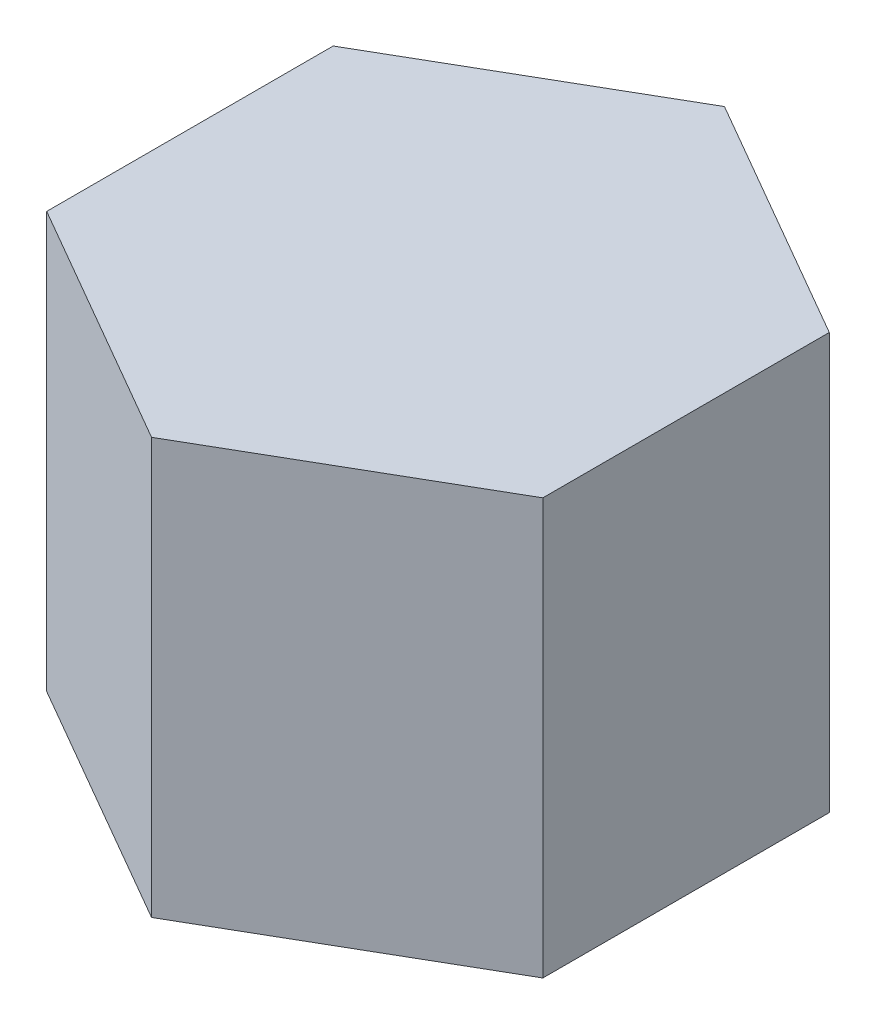
ISO-10303-21;
HEADER;
FILE_DESCRIPTION(('STEP AP214'),'2;1');
FILE_NAME('part.step','',(''),(''),'','','');
FILE_SCHEMA(('AUTOMOTIVE_DESIGN { 1 0 10303 214 1 1 1 1 }'));
ENDSEC;
DATA;
#1=APPLICATION_CONTEXT('core data for automotive mechanical design processes');
#2=APPLICATION_PROTOCOL_DEFINITION('international standard','automotive_design',2000,#1);
#3=PRODUCT_CONTEXT('',#1,'mechanical');
#4=PRODUCT('Part','Part','',(#3));
#5=PRODUCT_RELATED_PRODUCT_CATEGORY('part','',(#4));
#6=PRODUCT_DEFINITION_FORMATION('','',#4);
#7=PRODUCT_DEFINITION_CONTEXT('part definition',#1,'design');
#8=PRODUCT_DEFINITION('design','',#6,#7);
#9=PRODUCT_DEFINITION_SHAPE('','',#8);
#10=(LENGTH_UNIT() NAMED_UNIT(*) SI_UNIT(.MILLI.,.METRE.));
#11=(NAMED_UNIT(*) PLANE_ANGLE_UNIT() SI_UNIT($,.RADIAN.));
#12=(NAMED_UNIT(*) SI_UNIT($,.STERADIAN.) SOLID_ANGLE_UNIT());
#13=UNCERTAINTY_MEASURE_WITH_UNIT(LENGTH_MEASURE(1.E-05),#10,'distance_accuracy_value','');
#14=(GEOMETRIC_REPRESENTATION_CONTEXT(3) GLOBAL_UNCERTAINTY_ASSIGNED_CONTEXT((#13)) GLOBAL_UNIT_ASSIGNED_CONTEXT((#10,
#11,#12)) REPRESENTATION_CONTEXT('',''));
#15=CARTESIAN_POINT('',(0.,0.,0.));
#16=DIRECTION('',(0.,0.,1.));
#17=DIRECTION('',(1.,0.,0.));
#18=AXIS2_PLACEMENT_3D('',#15,#16,#17);
#19=CARTESIAN_POINT('',(203.642660308706,-148.537700895744,288.042869605357));
#20=DIRECTION('',(-0.499999999999943,0.,-0.866025403784472));
#21=DIRECTION('',(-0.866025403784472,0.,0.499999999999943));
#22=AXIS2_PLACEMENT_3D('',#19,#20,#21);
#23=PLANE('',#22);
#24=CARTESIAN_POINT('',(203.339551417382,-149.045793579175,288.217869605357));
#25=DIRECTION('',(0.866025403784471,0.,-0.499999999999943));
#26=VECTOR('',#25,1.);
#27=LINE('',#24,#26);
#28=CARTESIAN_POINT('',(203.339551417382,-149.045793579175,288.217869605357));
#29=VERTEX_POINT('',#28);
#30=CARTESIAN_POINT('',(203.642660308706,-149.045793579175,288.042869605357));
#31=VERTEX_POINT('',#30);
#32=EDGE_CURVE('E170',#29,#31,#27,.T.);
#33=ORIENTED_EDGE('',*,*,#32,.T.);
#34=CARTESIAN_POINT('',(203.642660308706,-148.537700895744,288.042869605357));
#35=DIRECTION('',(0.,-1.,0.));
#36=VECTOR('',#35,1.);
#37=LINE('',#34,#36);
#38=CARTESIAN_POINT('',(203.642660308706,-148.537700895744,288.042869605357));
#39=VERTEX_POINT('',#38);
#40=EDGE_CURVE('E35',#39,#31,#37,.T.);
#41=ORIENTED_EDGE('',*,*,#40,.F.);
#42=CARTESIAN_POINT('',(203.339551417382,-148.537700895744,288.217869605357));
#43=DIRECTION('',(0.866025403784471,0.,-0.499999999999943));
#44=VECTOR('',#43,1.);
#45=LINE('',#42,#44);
#46=CARTESIAN_POINT('',(203.339551417382,-148.537700895744,288.217869605357));
#47=VERTEX_POINT('',#46);
#48=EDGE_CURVE('E159',#47,#39,#45,.T.);
#49=ORIENTED_EDGE('',*,*,#48,.F.);
#50=CARTESIAN_POINT('',(203.339551417382,-148.537700895744,288.217869605357));
#51=DIRECTION('',(0.,-1.,0.));
#52=VECTOR('',#51,1.);
#53=LINE('',#50,#52);
#54=EDGE_CURVE('E10',#47,#29,#53,.T.);
#55=ORIENTED_EDGE('',*,*,#54,.T.);
#56=EDGE_LOOP('',(#33,#41,#49,#55));
#57=FACE_BOUND('',#56,.T.);
#58=ADVANCED_FACE('F16',(#57),#23,.F.);
#59=CARTESIAN_POINT('',(203.339551417382,-148.537700895744,288.217869605357));
#60=DIRECTION('',(0.500000000000062,0.,-0.866025403784403));
#61=DIRECTION('',(-0.866025403784403,0.,-0.500000000000062));
#62=AXIS2_PLACEMENT_3D('',#59,#60,#61);
#63=PLANE('',#62);
#64=CARTESIAN_POINT('',(203.036442526057,-149.045793579175,288.042869605357));
#65=DIRECTION('',(0.866025403784403,0.,0.500000000000062));
#66=VECTOR('',#65,1.);
#67=LINE('',#64,#66);
#68=CARTESIAN_POINT('',(203.036442526057,-149.045793579175,288.042869605357));
#69=VERTEX_POINT('',#68);
#70=EDGE_CURVE('E167',#69,#29,#67,.T.);
#71=ORIENTED_EDGE('',*,*,#70,.T.);
#72=ORIENTED_EDGE('',*,*,#54,.F.);
#73=CARTESIAN_POINT('',(203.036442526057,-148.537700895744,288.042869605357));
#74=DIRECTION('',(0.866025403784403,0.,0.500000000000062));
#75=VECTOR('',#74,1.);
#76=LINE('',#73,#75);
#77=CARTESIAN_POINT('',(203.036442526057,-148.537700895744,288.042869605357));
#78=VERTEX_POINT('',#77);
#79=EDGE_CURVE('E156',#78,#47,#76,.T.);
#80=ORIENTED_EDGE('',*,*,#79,.F.);
#81=CARTESIAN_POINT('',(203.036442526057,-148.537700895744,288.042869605357));
#82=DIRECTION('',(0.,-1.,0.));
#83=VECTOR('',#82,1.);
#84=LINE('',#81,#83);
#85=EDGE_CURVE('E27',#78,#69,#84,.T.);
#86=ORIENTED_EDGE('',*,*,#85,.T.);
#87=EDGE_LOOP('',(#71,#72,#80,#86));
#88=FACE_BOUND('',#87,.T.);
#89=ADVANCED_FACE('F189',(#88),#63,.F.);
#90=CARTESIAN_POINT('',(203.036442526057,-148.537700895744,290.831971220494));
#91=DIRECTION('',(1.,0.,0.));
#92=DIRECTION('',(0.,1.,0.));
#93=AXIS2_PLACEMENT_3D('',#90,#91,#92);
#94=PLANE('',#93);
#95=CARTESIAN_POINT('',(203.036442526057,-149.045793579175,287.692869605357));
#96=DIRECTION('',(0.,0.,1.));
#97=VECTOR('',#96,1.);
#98=LINE('',#95,#97);
#99=CARTESIAN_POINT('',(203.036442526057,-149.045793579175,287.692869605357));
#100=VERTEX_POINT('',#99);
#101=EDGE_CURVE('E163',#100,#69,#98,.T.);
#102=ORIENTED_EDGE('',*,*,#101,.T.);
#103=ORIENTED_EDGE('',*,*,#85,.F.);
#104=CARTESIAN_POINT('',(203.036442526057,-148.537700895744,287.692869605357));
#105=DIRECTION('',(0.,0.,1.));
#106=VECTOR('',#105,1.);
#107=LINE('',#104,#106);
#108=CARTESIAN_POINT('',(203.036442526057,-148.537700895744,287.692869605357));
#109=VERTEX_POINT('',#108);
#110=EDGE_CURVE('E106',#109,#78,#107,.T.);
#111=ORIENTED_EDGE('',*,*,#110,.F.);
#112=CARTESIAN_POINT('',(203.036442526057,-148.537700895744,287.692869605357));
#113=DIRECTION('',(0.,-1.,0.));
#114=VECTOR('',#113,1.);
#115=LINE('',#112,#114);
#116=EDGE_CURVE('E94',#109,#100,#115,.T.);
#117=ORIENTED_EDGE('',*,*,#116,.T.);
#118=EDGE_LOOP('',(#102,#103,#111,#117));
#119=FACE_BOUND('',#118,.T.);
#120=ADVANCED_FACE('F198',(#119),#94,.F.);
#121=CARTESIAN_POINT('',(203.036442526057,-148.537700895744,287.692869605357));
#122=DIRECTION('',(0.499999999999978,0.,0.866025403784452));
#123=DIRECTION('',(0.866025403784452,0.,-0.499999999999978));
#124=AXIS2_PLACEMENT_3D('',#121,#122,#123);
#125=PLANE('',#124);
#126=CARTESIAN_POINT('',(203.339551417382,-149.045793579175,287.517869605357));
#127=DIRECTION('',(-0.866025403784452,0.,0.499999999999978));
#128=VECTOR('',#127,1.);
#129=LINE('',#126,#128);
#130=CARTESIAN_POINT('',(203.339551417382,-149.045793579175,287.517869605357));
#131=VERTEX_POINT('',#130);
#132=EDGE_CURVE('E162',#131,#100,#129,.T.);
#133=ORIENTED_EDGE('',*,*,#132,.T.);
#134=ORIENTED_EDGE('',*,*,#116,.F.);
#135=CARTESIAN_POINT('',(203.339551417382,-148.537700895744,287.517869605357));
#136=DIRECTION('',(-0.866025403784452,0.,0.499999999999978));
#137=VECTOR('',#136,1.);
#138=LINE('',#135,#137);
#139=CARTESIAN_POINT('',(203.339551417382,-148.537700895744,287.517869605357));
#140=VERTEX_POINT('',#139);
#141=EDGE_CURVE('E98',#140,#109,#138,.T.);
#142=ORIENTED_EDGE('',*,*,#141,.F.);
#143=CARTESIAN_POINT('',(203.339551417382,-148.537700895744,287.517869605357));
#144=DIRECTION('',(0.,-1.,0.));
#145=VECTOR('',#144,1.);
#146=LINE('',#143,#145);
#147=EDGE_CURVE('E79',#140,#131,#146,.T.);
#148=ORIENTED_EDGE('',*,*,#147,.T.);
#149=EDGE_LOOP('',(#133,#134,#142,#148));
#150=FACE_BOUND('',#149,.T.);
#151=ADVANCED_FACE('F100',(#150),#125,.F.);
#152=CARTESIAN_POINT('',(203.339551417382,-148.537700895744,287.517869605357));
#153=DIRECTION('',(-0.500000000000012,0.,0.866025403784432));
#154=DIRECTION('',(0.866025403784432,0.,0.500000000000012));
#155=AXIS2_PLACEMENT_3D('',#152,#153,#154);
#156=PLANE('',#155);
#157=CARTESIAN_POINT('',(203.642660308706,-149.045793579175,287.692869605357));
#158=DIRECTION('',(-0.866025403784432,0.,-0.500000000000012));
#159=VECTOR('',#158,1.);
#160=LINE('',#157,#159);
#161=CARTESIAN_POINT('',(203.642660308706,-149.045793579175,287.692869605357));
#162=VERTEX_POINT('',#161);
#163=EDGE_CURVE('E88',#162,#131,#160,.T.);
#164=ORIENTED_EDGE('',*,*,#163,.T.);
#165=ORIENTED_EDGE('',*,*,#147,.F.);
#166=CARTESIAN_POINT('',(203.642660308706,-148.537700895744,287.692869605357));
#167=DIRECTION('',(-0.866025403784432,0.,-0.500000000000012));
#168=VECTOR('',#167,1.);
#169=LINE('',#166,#168);
#170=CARTESIAN_POINT('',(203.642660308706,-148.537700895744,287.692869605357));
#171=VERTEX_POINT('',#170);
#172=EDGE_CURVE('E84',#171,#140,#169,.T.);
#173=ORIENTED_EDGE('',*,*,#172,.F.);
#174=CARTESIAN_POINT('',(203.642660308706,-148.537700895744,287.692869605357));
#175=DIRECTION('',(0.,-1.,0.));
#176=VECTOR('',#175,1.);
#177=LINE('',#174,#176);
#178=EDGE_CURVE('E58',#171,#162,#177,.T.);
#179=ORIENTED_EDGE('',*,*,#178,.T.);
#180=EDGE_LOOP('',(#164,#165,#173,#179));
#181=FACE_BOUND('',#180,.T.);
#182=ADVANCED_FACE('F82',(#181),#156,.F.);
#183=CARTESIAN_POINT('',(203.642660308706,-148.537700895744,290.831971220494));
#184=DIRECTION('',(-1.,0.,0.));
#185=DIRECTION('',(0.,-1.,0.));
#186=AXIS2_PLACEMENT_3D('',#183,#184,#185);
#187=PLANE('',#186);
#188=CARTESIAN_POINT('',(203.642660308706,-149.045793579175,288.042869605357));
#189=DIRECTION('',(0.,0.,-1.));
#190=VECTOR('',#189,1.);
#191=LINE('',#188,#190);
#192=EDGE_CURVE('E160',#31,#162,#191,.T.);
#193=ORIENTED_EDGE('',*,*,#192,.T.);
#194=ORIENTED_EDGE('',*,*,#178,.F.);
#195=CARTESIAN_POINT('',(203.642660308706,-148.537700895744,288.042869605357));
#196=DIRECTION('',(0.,0.,-1.));
#197=VECTOR('',#196,1.);
#198=LINE('',#195,#197);
#199=EDGE_CURVE('E112',#39,#171,#198,.T.);
#200=ORIENTED_EDGE('',*,*,#199,.F.);
#201=ORIENTED_EDGE('',*,*,#40,.T.);
#202=EDGE_LOOP('',(#193,#194,#200,#201));
#203=FACE_BOUND('',#202,.T.);
#204=ADVANCED_FACE('F131',(#203),#187,.F.);
#205=CARTESIAN_POINT('',(206.339551417382,-148.537700895744,290.831971220494));
#206=DIRECTION('',(0.,-1.,0.));
#207=DIRECTION('',(1.,0.,0.));
#208=AXIS2_PLACEMENT_3D('',#205,#206,#207);
#209=PLANE('',#208);
#210=ORIENTED_EDGE('',*,*,#48,.T.);
#211=ORIENTED_EDGE('',*,*,#199,.T.);
#212=ORIENTED_EDGE('',*,*,#172,.T.);
#213=ORIENTED_EDGE('',*,*,#141,.T.);
#214=ORIENTED_EDGE('',*,*,#110,.T.);
#215=ORIENTED_EDGE('',*,*,#79,.T.);
#216=EDGE_LOOP('',(#210,#211,#212,#213,#214,#215));
#217=FACE_BOUND('',#216,.T.);
#218=ADVANCED_FACE('F111',(#217),#209,.F.);
#219=CARTESIAN_POINT('',(206.339551417382,-149.045793579175,290.831971220494));
#220=DIRECTION('',(0.,-1.,0.));
#221=DIRECTION('',(1.,0.,0.));
#222=AXIS2_PLACEMENT_3D('',#219,#220,#221);
#223=PLANE('',#222);
#224=ORIENTED_EDGE('',*,*,#32,.F.);
#225=ORIENTED_EDGE('',*,*,#70,.F.);
#226=ORIENTED_EDGE('',*,*,#101,.F.);
#227=ORIENTED_EDGE('',*,*,#132,.F.);
#228=ORIENTED_EDGE('',*,*,#163,.F.);
#229=ORIENTED_EDGE('',*,*,#192,.F.);
#230=EDGE_LOOP('',(#224,#225,#226,#227,#228,#229));
#231=FACE_BOUND('',#230,.T.);
#232=ADVANCED_FACE('F130',(#231),#223,.T.);
#233=CLOSED_SHELL('',(#58,#89,#120,#151,#182,#204,#218,#232));
#234=MANIFOLD_SOLID_BREP('B1',#233);
#235=ADVANCED_BREP_SHAPE_REPRESENTATION('',(#18,#234),#14);
#236=SHAPE_DEFINITION_REPRESENTATION(#9,#235);
ENDSEC;
END-ISO-10303-21;
